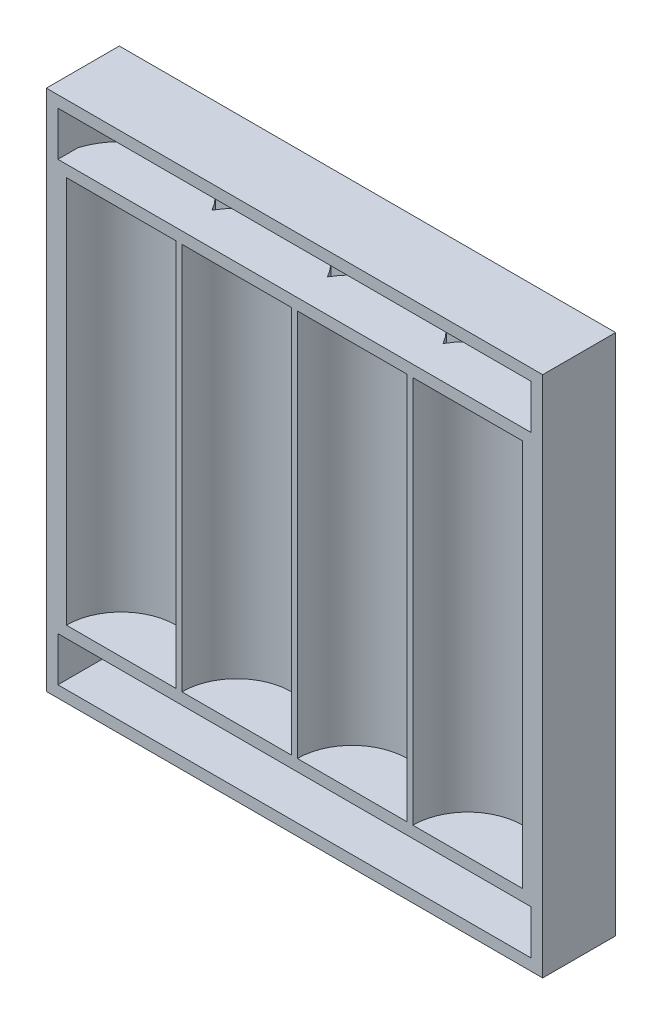
ISO-10303-21;
HEADER;
FILE_DESCRIPTION(('STEP AP214'),'2;1');
FILE_NAME('part.step','',(''),(''),'','','');
FILE_SCHEMA(('AUTOMOTIVE_DESIGN { 1 0 10303 214 1 1 1 1 }'));
ENDSEC;
DATA;
#1=APPLICATION_CONTEXT('core data for automotive mechanical design processes');
#2=APPLICATION_PROTOCOL_DEFINITION('international standard','automotive_design',2000,#1);
#3=PRODUCT_CONTEXT('',#1,'mechanical');
#4=PRODUCT('Part','Part','',(#3));
#5=PRODUCT_RELATED_PRODUCT_CATEGORY('part','',(#4));
#6=PRODUCT_DEFINITION_FORMATION('','',#4);
#7=PRODUCT_DEFINITION_CONTEXT('part definition',#1,'design');
#8=PRODUCT_DEFINITION('design','',#6,#7);
#9=PRODUCT_DEFINITION_SHAPE('','',#8);
#10=(LENGTH_UNIT() NAMED_UNIT(*) SI_UNIT(.MILLI.,.METRE.));
#11=(NAMED_UNIT(*) PLANE_ANGLE_UNIT() SI_UNIT($,.RADIAN.));
#12=(NAMED_UNIT(*) SI_UNIT($,.STERADIAN.) SOLID_ANGLE_UNIT());
#13=UNCERTAINTY_MEASURE_WITH_UNIT(LENGTH_MEASURE(1.E-05),#10,'distance_accuracy_value','');
#14=(GEOMETRIC_REPRESENTATION_CONTEXT(3) GLOBAL_UNCERTAINTY_ASSIGNED_CONTEXT((#13)) GLOBAL_UNIT_ASSIGNED_CONTEXT((#10,
#11,#12)) REPRESENTATION_CONTEXT('',''));
#15=CARTESIAN_POINT('',(0.,0.,0.));
#16=DIRECTION('',(0.,0.,1.));
#17=DIRECTION('',(1.,0.,0.));
#18=AXIS2_PLACEMENT_3D('',#15,#16,#17);
#19=CARTESIAN_POINT('',(0.,67.85,9.475));
#20=DIRECTION('',(0.,0.,-1.));
#21=DIRECTION('',(-1.,0.,0.));
#22=AXIS2_PLACEMENT_3D('',#19,#20,#21);
#23=PLANE('',#22);
#24=DIRECTION('',(1.,0.,0.));
#25=VECTOR('',#24,1.);
#26=CARTESIAN_POINT('',(24.725,7.255,9.475));
#27=LINE('',#26,#25);
#28=CARTESIAN_POINT('',(1.5,7.255,9.475));
#29=VERTEX_POINT('',#28);
#30=CARTESIAN_POINT('',(62.95,7.255,9.475));
#31=VERTEX_POINT('',#30);
#32=EDGE_CURVE('E232',#29,#31,#27,.T.);
#33=ORIENTED_EDGE('',*,*,#32,.T.);
#34=DIRECTION('',(0.,-1.,0.));
#35=VECTOR('',#34,1.);
#36=CARTESIAN_POINT('',(62.95,0.,9.475));
#37=LINE('',#36,#35);
#38=CARTESIAN_POINT('',(62.95,1.5,9.475));
#39=VERTEX_POINT('',#38);
#40=EDGE_CURVE('E229',#31,#39,#37,.T.);
#41=ORIENTED_EDGE('',*,*,#40,.T.);
#42=DIRECTION('',(1.,0.,0.));
#43=VECTOR('',#42,1.);
#44=CARTESIAN_POINT('',(0.,1.5,9.475));
#45=LINE('',#44,#43);
#46=CARTESIAN_POINT('',(1.5,1.5,9.475));
#47=VERTEX_POINT('',#46);
#48=EDGE_CURVE('E226',#47,#39,#45,.T.);
#49=ORIENTED_EDGE('',*,*,#48,.F.);
#50=DIRECTION('',(0.,-1.,0.));
#51=VECTOR('',#50,1.);
#52=CARTESIAN_POINT('',(1.5,67.85,9.475));
#53=LINE('',#52,#51);
#54=EDGE_CURVE('E193',#29,#47,#53,.T.);
#55=ORIENTED_EDGE('',*,*,#54,.F.);
#56=EDGE_LOOP('',(#33,#41,#49,#55));
#57=FACE_BOUND('',#56,.T.);
#58=DIRECTION('',(1.,0.,0.));
#59=VECTOR('',#58,1.);
#60=CARTESIAN_POINT('',(0.,0.,9.475));
#61=LINE('',#60,#59);
#62=CARTESIAN_POINT('',(0.,0.,9.475));
#63=VERTEX_POINT('',#62);
#64=CARTESIAN_POINT('',(64.45,0.,9.475));
#65=VERTEX_POINT('',#64);
#66=EDGE_CURVE('E275',#63,#65,#61,.T.);
#67=ORIENTED_EDGE('',*,*,#66,.T.);
#68=DIRECTION('',(0.,-1.,0.));
#69=VECTOR('',#68,1.);
#70=CARTESIAN_POINT('',(64.45,67.85,9.475));
#71=LINE('',#70,#69);
#72=CARTESIAN_POINT('',(64.45,67.85,9.475));
#73=VERTEX_POINT('',#72);
#74=EDGE_CURVE('E281',#73,#65,#71,.T.);
#75=ORIENTED_EDGE('',*,*,#74,.F.);
#76=DIRECTION('',(1.,0.,0.));
#77=VECTOR('',#76,1.);
#78=CARTESIAN_POINT('',(0.,67.85,9.475));
#79=LINE('',#78,#77);
#80=CARTESIAN_POINT('',(0.,67.85,9.475));
#81=VERTEX_POINT('',#80);
#82=EDGE_CURVE('E276',#81,#73,#79,.T.);
#83=ORIENTED_EDGE('',*,*,#82,.F.);
#84=DIRECTION('',(0.,-1.,0.));
#85=VECTOR('',#84,1.);
#86=CARTESIAN_POINT('',(0.,67.85,9.475));
#87=LINE('',#86,#85);
#88=EDGE_CURVE('E279',#81,#63,#87,.T.);
#89=ORIENTED_EDGE('',*,*,#88,.T.);
#90=EDGE_LOOP('',(#67,#75,#83,#89));
#91=FACE_BOUND('',#90,.T.);
#92=DIRECTION('',(1.,0.,0.));
#93=VECTOR('',#92,1.);
#94=CARTESIAN_POINT('',(54.725,59.095,9.475));
#95=LINE('',#94,#93);
#96=CARTESIAN_POINT('',(47.59,59.095,9.475));
#97=VERTEX_POINT('',#96);
#98=CARTESIAN_POINT('',(61.86,59.095,9.475));
#99=VERTEX_POINT('',#98);
#100=EDGE_CURVE('E291',#97,#99,#95,.T.);
#101=ORIENTED_EDGE('',*,*,#100,.T.);
#102=DIRECTION('',(0.,-1.,0.));
#103=VECTOR('',#102,1.);
#104=CARTESIAN_POINT('',(61.86,59.095,9.475));
#105=LINE('',#104,#103);
#106=CARTESIAN_POINT('',(61.86,8.755,9.475));
#107=VERTEX_POINT('',#106);
#108=EDGE_CURVE('E288',#107,#99,#105,.F.);
#109=ORIENTED_EDGE('',*,*,#108,.F.);
#110=DIRECTION('',(1.,0.,0.));
#111=VECTOR('',#110,1.);
#112=CARTESIAN_POINT('',(54.725,8.755,9.475));
#113=LINE('',#112,#111);
#114=CARTESIAN_POINT('',(47.59,8.755,9.475));
#115=VERTEX_POINT('',#114);
#116=EDGE_CURVE('E11',#115,#107,#113,.T.);
#117=ORIENTED_EDGE('',*,*,#116,.F.);
#118=DIRECTION('',(0.,-1.,0.));
#119=VECTOR('',#118,1.);
#120=CARTESIAN_POINT('',(47.59,59.095,9.475));
#121=LINE('',#120,#119);
#122=EDGE_CURVE('E284',#97,#115,#121,.T.);
#123=ORIENTED_EDGE('',*,*,#122,.F.);
#124=EDGE_LOOP('',(#101,#109,#117,#123));
#125=FACE_BOUND('',#124,.T.);
#126=DIRECTION('',(1.,0.,0.));
#127=VECTOR('',#126,1.);
#128=CARTESIAN_POINT('',(39.725,59.095,9.475));
#129=LINE('',#128,#127);
#130=CARTESIAN_POINT('',(32.59,59.095,9.475));
#131=VERTEX_POINT('',#130);
#132=CARTESIAN_POINT('',(46.86,59.095,9.475));
#133=VERTEX_POINT('',#132);
#134=EDGE_CURVE('E302',#131,#133,#129,.T.);
#135=ORIENTED_EDGE('',*,*,#134,.T.);
#136=DIRECTION('',(0.,-1.,0.));
#137=VECTOR('',#136,1.);
#138=CARTESIAN_POINT('',(46.86,59.095,9.475));
#139=LINE('',#138,#137);
#140=CARTESIAN_POINT('',(46.86,8.755,9.475));
#141=VERTEX_POINT('',#140);
#142=EDGE_CURVE('E299',#141,#133,#139,.F.);
#143=ORIENTED_EDGE('',*,*,#142,.F.);
#144=DIRECTION('',(1.,0.,0.));
#145=VECTOR('',#144,1.);
#146=CARTESIAN_POINT('',(39.725,8.755,9.475));
#147=LINE('',#146,#145);
#148=CARTESIAN_POINT('',(32.59,8.755,9.475));
#149=VERTEX_POINT('',#148);
#150=EDGE_CURVE('E293',#149,#141,#147,.T.);
#151=ORIENTED_EDGE('',*,*,#150,.F.);
#152=DIRECTION('',(0.,-1.,0.));
#153=VECTOR('',#152,1.);
#154=CARTESIAN_POINT('',(32.59,59.095,9.475));
#155=LINE('',#154,#153);
#156=EDGE_CURVE('E296',#131,#149,#155,.T.);
#157=ORIENTED_EDGE('',*,*,#156,.F.);
#158=EDGE_LOOP('',(#135,#143,#151,#157));
#159=FACE_BOUND('',#158,.T.);
#160=DIRECTION('',(1.,0.,0.));
#161=VECTOR('',#160,1.);
#162=CARTESIAN_POINT('',(24.725,59.095,9.475));
#163=LINE('',#162,#161);
#164=CARTESIAN_POINT('',(17.59,59.095,9.475));
#165=VERTEX_POINT('',#164);
#166=CARTESIAN_POINT('',(31.86,59.095,9.475));
#167=VERTEX_POINT('',#166);
#168=EDGE_CURVE('E313',#165,#167,#163,.T.);
#169=ORIENTED_EDGE('',*,*,#168,.T.);
#170=DIRECTION('',(0.,-1.,0.));
#171=VECTOR('',#170,1.);
#172=CARTESIAN_POINT('',(31.86,59.095,9.475));
#173=LINE('',#172,#171);
#174=CARTESIAN_POINT('',(31.86,8.755,9.475));
#175=VERTEX_POINT('',#174);
#176=EDGE_CURVE('E310',#175,#167,#173,.F.);
#177=ORIENTED_EDGE('',*,*,#176,.F.);
#178=DIRECTION('',(1.,0.,0.));
#179=VECTOR('',#178,1.);
#180=CARTESIAN_POINT('',(24.725,8.755,9.475));
#181=LINE('',#180,#179);
#182=CARTESIAN_POINT('',(17.59,8.755,9.475));
#183=VERTEX_POINT('',#182);
#184=EDGE_CURVE('E304',#183,#175,#181,.T.);
#185=ORIENTED_EDGE('',*,*,#184,.F.);
#186=DIRECTION('',(0.,-1.,0.));
#187=VECTOR('',#186,1.);
#188=CARTESIAN_POINT('',(17.59,59.095,9.475));
#189=LINE('',#188,#187);
#190=EDGE_CURVE('E307',#165,#183,#189,.T.);
#191=ORIENTED_EDGE('',*,*,#190,.F.);
#192=EDGE_LOOP('',(#169,#177,#185,#191));
#193=FACE_BOUND('',#192,.T.);
#194=DIRECTION('',(1.,0.,0.));
#195=VECTOR('',#194,1.);
#196=CARTESIAN_POINT('',(9.725,59.095,9.475));
#197=LINE('',#196,#195);
#198=CARTESIAN_POINT('',(2.59,59.095,9.475));
#199=VERTEX_POINT('',#198);
#200=CARTESIAN_POINT('',(16.86,59.095,9.475));
#201=VERTEX_POINT('',#200);
#202=EDGE_CURVE('E324',#199,#201,#197,.T.);
#203=ORIENTED_EDGE('',*,*,#202,.T.);
#204=DIRECTION('',(0.,-1.,0.));
#205=VECTOR('',#204,1.);
#206=CARTESIAN_POINT('',(16.86,59.095,9.475));
#207=LINE('',#206,#205);
#208=CARTESIAN_POINT('',(16.86,8.755,9.475));
#209=VERTEX_POINT('',#208);
#210=EDGE_CURVE('E321',#209,#201,#207,.F.);
#211=ORIENTED_EDGE('',*,*,#210,.F.);
#212=DIRECTION('',(1.,0.,0.));
#213=VECTOR('',#212,1.);
#214=CARTESIAN_POINT('',(9.725,8.755,9.475));
#215=LINE('',#214,#213);
#216=CARTESIAN_POINT('',(2.59,8.755,9.475));
#217=VERTEX_POINT('',#216);
#218=EDGE_CURVE('E315',#217,#209,#215,.T.);
#219=ORIENTED_EDGE('',*,*,#218,.F.);
#220=DIRECTION('',(0.,-1.,0.));
#221=VECTOR('',#220,1.);
#222=CARTESIAN_POINT('',(2.59,59.095,9.475));
#223=LINE('',#222,#221);
#224=EDGE_CURVE('E318',#199,#217,#223,.T.);
#225=ORIENTED_EDGE('',*,*,#224,.F.);
#226=EDGE_LOOP('',(#203,#211,#219,#225));
#227=FACE_BOUND('',#226,.T.);
#228=DIRECTION('',(1.,0.,0.));
#229=VECTOR('',#228,1.);
#230=CARTESIAN_POINT('',(24.725,60.595,9.475));
#231=LINE('',#230,#229);
#232=CARTESIAN_POINT('',(1.5,60.595,9.475));
#233=VERTEX_POINT('',#232);
#234=CARTESIAN_POINT('',(62.95,60.595,9.475));
#235=VERTEX_POINT('',#234);
#236=EDGE_CURVE('E246',#233,#235,#231,.T.);
#237=ORIENTED_EDGE('',*,*,#236,.F.);
#238=CARTESIAN_POINT('',(1.5,66.35,9.475));
#239=VERTEX_POINT('',#238);
#240=EDGE_CURVE('E223',#239,#233,#53,.T.);
#241=ORIENTED_EDGE('',*,*,#240,.F.);
#242=DIRECTION('',(1.,0.,0.));
#243=VECTOR('',#242,1.);
#244=CARTESIAN_POINT('',(0.,66.35,9.475));
#245=LINE('',#244,#243);
#246=CARTESIAN_POINT('',(62.95,66.35,9.475));
#247=VERTEX_POINT('',#246);
#248=EDGE_CURVE('E228',#239,#247,#245,.T.);
#249=ORIENTED_EDGE('',*,*,#248,.T.);
#250=EDGE_CURVE('E225',#247,#235,#37,.T.);
#251=ORIENTED_EDGE('',*,*,#250,.T.);
#252=EDGE_LOOP('',(#237,#241,#249,#251));
#253=FACE_BOUND('',#252,.T.);
#254=ADVANCED_FACE('F36',(#57,#91,#125,#159,#193,#227,#253),#23,.F.);
#255=CARTESIAN_POINT('',(54.725,59.095,9.475));
#256=DIRECTION('',(0.,-1.,0.));
#257=DIRECTION('',(0.,0.,-1.));
#258=AXIS2_PLACEMENT_3D('',#255,#256,#257);
#259=CYLINDRICAL_SURFACE('',#258,7.135);
#260=CARTESIAN_POINT('',(54.725,8.755,9.475));
#261=DIRECTION('',(0.,-1.,0.));
#262=DIRECTION('',(0.,0.,-1.));
#263=AXIS2_PLACEMENT_3D('',#260,#261,#262);
#264=CIRCLE('',#263,7.135);
#265=EDGE_CURVE('E346',#115,#107,#264,.T.);
#266=ORIENTED_EDGE('',*,*,#265,.T.);
#267=ORIENTED_EDGE('',*,*,#108,.T.);
#268=CARTESIAN_POINT('',(54.725,59.095,9.475));
#269=DIRECTION('',(0.,-1.,0.));
#270=DIRECTION('',(0.,0.,-1.));
#271=AXIS2_PLACEMENT_3D('',#268,#269,#270);
#272=CIRCLE('',#271,7.135);
#273=EDGE_CURVE('E326',#97,#99,#272,.T.);
#274=ORIENTED_EDGE('',*,*,#273,.F.);
#275=ORIENTED_EDGE('',*,*,#122,.T.);
#276=EDGE_LOOP('',(#266,#267,#274,#275));
#277=FACE_BOUND('',#276,.T.);
#278=ADVANCED_FACE('F389',(#277),#259,.F.);
#279=CARTESIAN_POINT('',(54.725,59.095,9.475));
#280=DIRECTION('',(0.,-1.,0.));
#281=DIRECTION('',(0.,0.,-1.));
#282=AXIS2_PLACEMENT_3D('',#279,#280,#281);
#283=PLANE('',#282);
#284=ORIENTED_EDGE('',*,*,#100,.F.);
#285=ORIENTED_EDGE('',*,*,#273,.T.);
#286=EDGE_LOOP('',(#284,#285));
#287=FACE_BOUND('',#286,.T.);
#288=ADVANCED_FACE('F474',(#287),#283,.T.);
#289=CARTESIAN_POINT('',(54.725,8.755,9.475));
#290=DIRECTION('',(0.,-1.,0.));
#291=DIRECTION('',(0.,0.,-1.));
#292=AXIS2_PLACEMENT_3D('',#289,#290,#291);
#293=PLANE('',#292);
#294=ORIENTED_EDGE('',*,*,#265,.F.);
#295=ORIENTED_EDGE('',*,*,#116,.T.);
#296=EDGE_LOOP('',(#294,#295));
#297=FACE_BOUND('',#296,.T.);
#298=ADVANCED_FACE('F464',(#297),#293,.F.);
#299=CARTESIAN_POINT('',(39.725,59.095,9.475));
#300=DIRECTION('',(0.,-1.,0.));
#301=DIRECTION('',(0.,0.,-1.));
#302=AXIS2_PLACEMENT_3D('',#299,#300,#301);
#303=CYLINDRICAL_SURFACE('',#302,7.135);
#304=CARTESIAN_POINT('',(39.725,8.755,9.475));
#305=DIRECTION('',(0.,-1.,0.));
#306=DIRECTION('',(0.,0.,-1.));
#307=AXIS2_PLACEMENT_3D('',#304,#305,#306);
#308=CIRCLE('',#307,7.135);
#309=EDGE_CURVE('E340',#149,#141,#308,.T.);
#310=ORIENTED_EDGE('',*,*,#309,.T.);
#311=ORIENTED_EDGE('',*,*,#142,.T.);
#312=CARTESIAN_POINT('',(39.725,59.095,9.475));
#313=DIRECTION('',(0.,-1.,0.));
#314=DIRECTION('',(0.,0.,-1.));
#315=AXIS2_PLACEMENT_3D('',#312,#313,#314);
#316=CIRCLE('',#315,7.135);
#317=EDGE_CURVE('E343',#131,#133,#316,.T.);
#318=ORIENTED_EDGE('',*,*,#317,.F.);
#319=ORIENTED_EDGE('',*,*,#156,.T.);
#320=EDGE_LOOP('',(#310,#311,#318,#319));
#321=FACE_BOUND('',#320,.T.);
#322=ADVANCED_FACE('F460',(#321),#303,.F.);
#323=CARTESIAN_POINT('',(39.725,59.095,9.475));
#324=DIRECTION('',(0.,-1.,0.));
#325=DIRECTION('',(0.,0.,-1.));
#326=AXIS2_PLACEMENT_3D('',#323,#324,#325);
#327=PLANE('',#326);
#328=ORIENTED_EDGE('',*,*,#134,.F.);
#329=ORIENTED_EDGE('',*,*,#317,.T.);
#330=EDGE_LOOP('',(#328,#329));
#331=FACE_BOUND('',#330,.T.);
#332=ADVANCED_FACE('F463',(#331),#327,.T.);
#333=CARTESIAN_POINT('',(39.725,8.755,9.475));
#334=DIRECTION('',(0.,-1.,0.));
#335=DIRECTION('',(0.,0.,-1.));
#336=AXIS2_PLACEMENT_3D('',#333,#334,#335);
#337=PLANE('',#336);
#338=ORIENTED_EDGE('',*,*,#309,.F.);
#339=ORIENTED_EDGE('',*,*,#150,.T.);
#340=EDGE_LOOP('',(#338,#339));
#341=FACE_BOUND('',#340,.T.);
#342=ADVANCED_FACE('F452',(#341),#337,.F.);
#343=CARTESIAN_POINT('',(24.725,59.095,9.475));
#344=DIRECTION('',(0.,-1.,0.));
#345=DIRECTION('',(0.,0.,-1.));
#346=AXIS2_PLACEMENT_3D('',#343,#344,#345);
#347=CYLINDRICAL_SURFACE('',#346,7.135);
#348=CARTESIAN_POINT('',(24.725,8.755,9.475));
#349=DIRECTION('',(0.,-1.,0.));
#350=DIRECTION('',(0.,0.,-1.));
#351=AXIS2_PLACEMENT_3D('',#348,#349,#350);
#352=CIRCLE('',#351,7.135);
#353=EDGE_CURVE('E334',#183,#175,#352,.T.);
#354=ORIENTED_EDGE('',*,*,#353,.T.);
#355=ORIENTED_EDGE('',*,*,#176,.T.);
#356=CARTESIAN_POINT('',(24.725,59.095,9.475));
#357=DIRECTION('',(0.,-1.,0.));
#358=DIRECTION('',(0.,0.,-1.));
#359=AXIS2_PLACEMENT_3D('',#356,#357,#358);
#360=CIRCLE('',#359,7.135);
#361=EDGE_CURVE('E337',#165,#167,#360,.T.);
#362=ORIENTED_EDGE('',*,*,#361,.F.);
#363=ORIENTED_EDGE('',*,*,#190,.T.);
#364=EDGE_LOOP('',(#354,#355,#362,#363));
#365=FACE_BOUND('',#364,.T.);
#366=ADVANCED_FACE('F448',(#365),#347,.F.);
#367=CARTESIAN_POINT('',(24.725,59.095,9.475));
#368=DIRECTION('',(0.,-1.,0.));
#369=DIRECTION('',(0.,0.,-1.));
#370=AXIS2_PLACEMENT_3D('',#367,#368,#369);
#371=PLANE('',#370);
#372=ORIENTED_EDGE('',*,*,#168,.F.);
#373=ORIENTED_EDGE('',*,*,#361,.T.);
#374=EDGE_LOOP('',(#372,#373));
#375=FACE_BOUND('',#374,.T.);
#376=ADVANCED_FACE('F451',(#375),#371,.T.);
#377=CARTESIAN_POINT('',(24.725,8.755,9.475));
#378=DIRECTION('',(0.,-1.,0.));
#379=DIRECTION('',(0.,0.,-1.));
#380=AXIS2_PLACEMENT_3D('',#377,#378,#379);
#381=PLANE('',#380);
#382=ORIENTED_EDGE('',*,*,#353,.F.);
#383=ORIENTED_EDGE('',*,*,#184,.T.);
#384=EDGE_LOOP('',(#382,#383));
#385=FACE_BOUND('',#384,.T.);
#386=ADVANCED_FACE('F446',(#385),#381,.F.);
#387=CARTESIAN_POINT('',(9.725,59.095,9.47499999999999));
#388=DIRECTION('',(0.,-1.,0.));
#389=DIRECTION('',(0.,0.,-1.));
#390=AXIS2_PLACEMENT_3D('',#387,#388,#389);
#391=CYLINDRICAL_SURFACE('',#390,7.135);
#392=CARTESIAN_POINT('',(9.725,8.755,9.47499999999999));
#393=DIRECTION('',(0.,-1.,0.));
#394=DIRECTION('',(0.,0.,-1.));
#395=AXIS2_PLACEMENT_3D('',#392,#393,#394);
#396=CIRCLE('',#395,7.135);
#397=EDGE_CURVE('E331',#217,#209,#396,.T.);
#398=ORIENTED_EDGE('',*,*,#397,.T.);
#399=ORIENTED_EDGE('',*,*,#210,.T.);
#400=CARTESIAN_POINT('',(9.725,59.095,9.47499999999999));
#401=DIRECTION('',(0.,-1.,0.));
#402=DIRECTION('',(0.,0.,-1.));
#403=AXIS2_PLACEMENT_3D('',#400,#401,#402);
#404=CIRCLE('',#403,7.135);
#405=EDGE_CURVE('E327',#199,#201,#404,.T.);
#406=ORIENTED_EDGE('',*,*,#405,.F.);
#407=ORIENTED_EDGE('',*,*,#224,.T.);
#408=EDGE_LOOP('',(#398,#399,#406,#407));
#409=FACE_BOUND('',#408,.T.);
#410=ADVANCED_FACE('F439',(#409),#391,.F.);
#411=CARTESIAN_POINT('',(9.725,59.095,9.47499999999999));
#412=DIRECTION('',(0.,-1.,0.));
#413=DIRECTION('',(0.,0.,-1.));
#414=AXIS2_PLACEMENT_3D('',#411,#412,#413);
#415=PLANE('',#414);
#416=ORIENTED_EDGE('',*,*,#202,.F.);
#417=ORIENTED_EDGE('',*,*,#405,.T.);
#418=EDGE_LOOP('',(#416,#417));
#419=FACE_BOUND('',#418,.T.);
#420=ADVANCED_FACE('F435',(#419),#415,.T.);
#421=CARTESIAN_POINT('',(9.725,8.755,9.47499999999999));
#422=DIRECTION('',(0.,-1.,0.));
#423=DIRECTION('',(0.,0.,-1.));
#424=AXIS2_PLACEMENT_3D('',#421,#422,#423);
#425=PLANE('',#424);
#426=ORIENTED_EDGE('',*,*,#397,.F.);
#427=ORIENTED_EDGE('',*,*,#218,.T.);
#428=EDGE_LOOP('',(#426,#427));
#429=FACE_BOUND('',#428,.T.);
#430=ADVANCED_FACE('F438',(#429),#425,.F.);
#431=CARTESIAN_POINT('',(0.,0.,18.95));
#432=DIRECTION('',(1.,0.,0.));
#433=DIRECTION('',(0.,0.,-1.));
#434=AXIS2_PLACEMENT_3D('',#431,#432,#433);
#435=PLANE('',#434);
#436=DIRECTION('',(0.,0.,-1.));
#437=VECTOR('',#436,1.);
#438=CARTESIAN_POINT('',(0.,0.,18.95));
#439=LINE('',#438,#437);
#440=CARTESIAN_POINT('',(0.,0.,0.));
#441=VERTEX_POINT('',#440);
#442=EDGE_CURVE('E44',#63,#441,#439,.T.);
#443=ORIENTED_EDGE('',*,*,#442,.F.);
#444=ORIENTED_EDGE('',*,*,#88,.F.);
#445=DIRECTION('',(0.,0.,-1.));
#446=VECTOR('',#445,1.);
#447=CARTESIAN_POINT('',(0.,67.85,18.95));
#448=LINE('',#447,#446);
#449=CARTESIAN_POINT('',(0.,67.85,0.));
#450=VERTEX_POINT('',#449);
#451=EDGE_CURVE('E362',#81,#450,#448,.T.);
#452=ORIENTED_EDGE('',*,*,#451,.T.);
#453=DIRECTION('',(0.,-1.,0.));
#454=VECTOR('',#453,1.);
#455=CARTESIAN_POINT('',(0.,0.,0.));
#456=LINE('',#455,#454);
#457=EDGE_CURVE('E330',#450,#441,#456,.T.);
#458=ORIENTED_EDGE('',*,*,#457,.T.);
#459=EDGE_LOOP('',(#443,#444,#452,#458));
#460=FACE_BOUND('',#459,.T.);
#461=ADVANCED_FACE('F38',(#460),#435,.F.);
#462=CARTESIAN_POINT('',(0.,0.,18.95));
#463=DIRECTION('',(0.,1.,0.));
#464=DIRECTION('',(0.,0.,1.));
#465=AXIS2_PLACEMENT_3D('',#462,#463,#464);
#466=PLANE('',#465);
#467=DIRECTION('',(0.,0.,-1.));
#468=VECTOR('',#467,1.);
#469=CARTESIAN_POINT('',(64.45,0.,18.95));
#470=LINE('',#469,#468);
#471=CARTESIAN_POINT('',(64.45,0.,0.));
#472=VERTEX_POINT('',#471);
#473=EDGE_CURVE('E366',#65,#472,#470,.T.);
#474=ORIENTED_EDGE('',*,*,#473,.F.);
#475=ORIENTED_EDGE('',*,*,#66,.F.);
#476=ORIENTED_EDGE('',*,*,#442,.T.);
#477=DIRECTION('',(1.,0.,0.));
#478=VECTOR('',#477,1.);
#479=CARTESIAN_POINT('',(0.,0.,0.));
#480=LINE('',#479,#478);
#481=EDGE_CURVE('E353',#441,#472,#480,.T.);
#482=ORIENTED_EDGE('',*,*,#481,.T.);
#483=EDGE_LOOP('',(#474,#475,#476,#482));
#484=FACE_BOUND('',#483,.T.);
#485=ADVANCED_FACE('F372',(#484),#466,.F.);
#486=CARTESIAN_POINT('',(64.45,0.,18.95));
#487=DIRECTION('',(-1.,0.,0.));
#488=DIRECTION('',(0.,0.,1.));
#489=AXIS2_PLACEMENT_3D('',#486,#487,#488);
#490=PLANE('',#489);
#491=DIRECTION('',(0.,0.,-1.));
#492=VECTOR('',#491,1.);
#493=CARTESIAN_POINT('',(64.45,67.85,18.95));
#494=LINE('',#493,#492);
#495=CARTESIAN_POINT('',(64.45,67.85,0.));
#496=VERTEX_POINT('',#495);
#497=EDGE_CURVE('E364',#73,#496,#494,.T.);
#498=ORIENTED_EDGE('',*,*,#497,.F.);
#499=ORIENTED_EDGE('',*,*,#74,.T.);
#500=ORIENTED_EDGE('',*,*,#473,.T.);
#501=DIRECTION('',(0.,1.,0.));
#502=VECTOR('',#501,1.);
#503=CARTESIAN_POINT('',(64.45,0.,0.));
#504=LINE('',#503,#502);
#505=EDGE_CURVE('E356',#472,#496,#504,.T.);
#506=ORIENTED_EDGE('',*,*,#505,.T.);
#507=EDGE_LOOP('',(#498,#499,#500,#506));
#508=FACE_BOUND('',#507,.T.);
#509=ADVANCED_FACE('F385',(#508),#490,.F.);
#510=CARTESIAN_POINT('',(0.,67.85,18.95));
#511=DIRECTION('',(0.,-1.,0.));
#512=DIRECTION('',(0.,0.,-1.));
#513=AXIS2_PLACEMENT_3D('',#510,#511,#512);
#514=PLANE('',#513);
#515=ORIENTED_EDGE('',*,*,#451,.F.);
#516=ORIENTED_EDGE('',*,*,#82,.T.);
#517=ORIENTED_EDGE('',*,*,#497,.T.);
#518=DIRECTION('',(-1.,0.,0.));
#519=VECTOR('',#518,1.);
#520=CARTESIAN_POINT('',(0.,67.85,0.));
#521=LINE('',#520,#519);
#522=EDGE_CURVE('E359',#496,#450,#521,.T.);
#523=ORIENTED_EDGE('',*,*,#522,.T.);
#524=EDGE_LOOP('',(#515,#516,#517,#523));
#525=FACE_BOUND('',#524,.T.);
#526=ADVANCED_FACE('F382',(#525),#514,.F.);
#527=CARTESIAN_POINT('',(0.,0.,0.));
#528=DIRECTION('',(0.,0.,-1.));
#529=DIRECTION('',(-1.,0.,0.));
#530=AXIS2_PLACEMENT_3D('',#527,#528,#529);
#531=PLANE('',#530);
#532=ORIENTED_EDGE('',*,*,#457,.F.);
#533=ORIENTED_EDGE('',*,*,#522,.F.);
#534=ORIENTED_EDGE('',*,*,#505,.F.);
#535=ORIENTED_EDGE('',*,*,#481,.F.);
#536=EDGE_LOOP('',(#532,#533,#534,#535));
#537=FACE_BOUND('',#536,.T.);
#538=ADVANCED_FACE('F378',(#537),#531,.T.);
#539=CARTESIAN_POINT('',(39.725,59.095,9.475));
#540=DIRECTION('',(0.,-1.,0.));
#541=DIRECTION('',(0.,0.,-1.));
#542=AXIS2_PLACEMENT_3D('',#539,#540,#541);
#543=CYLINDRICAL_SURFACE('',#542,8.635);
#544=DIRECTION('',(0.,-1.,0.));
#545=VECTOR('',#544,1.);
#546=CARTESIAN_POINT('',(47.225,33.925,5.19560459877798));
#547=LINE('',#546,#545);
#548=CARTESIAN_POINT('',(47.225,60.595,5.19560459877799));
#549=VERTEX_POINT('',#548);
#550=CARTESIAN_POINT('',(47.225,7.255,5.19560459877799));
#551=VERTEX_POINT('',#550);
#552=EDGE_CURVE('E273',#549,#551,#547,.T.);
#553=ORIENTED_EDGE('',*,*,#552,.T.);
#554=CARTESIAN_POINT('',(39.725,7.255,9.475));
#555=DIRECTION('',(0.,-1.,0.));
#556=DIRECTION('',(0.,0.,-1.));
#557=AXIS2_PLACEMENT_3D('',#554,#555,#556);
#558=CIRCLE('',#557,8.635);
#559=CARTESIAN_POINT('',(32.225,7.255,5.19560459877799));
#560=VERTEX_POINT('',#559);
#561=EDGE_CURVE('E243',#560,#551,#558,.T.);
#562=ORIENTED_EDGE('',*,*,#561,.F.);
#563=DIRECTION('',(0.,-1.,0.));
#564=VECTOR('',#563,1.);
#565=CARTESIAN_POINT('',(32.225,33.925,5.19560459877799));
#566=LINE('',#565,#564);
#567=CARTESIAN_POINT('',(32.225,60.595,5.19560459877799));
#568=VERTEX_POINT('',#567);
#569=EDGE_CURVE('E269',#560,#568,#566,.F.);
#570=ORIENTED_EDGE('',*,*,#569,.T.);
#571=CARTESIAN_POINT('',(39.725,60.595,9.475));
#572=DIRECTION('',(0.,-1.,0.));
#573=DIRECTION('',(0.,0.,-1.));
#574=AXIS2_PLACEMENT_3D('',#571,#572,#573);
#575=CIRCLE('',#574,8.635);
#576=EDGE_CURVE('E252',#568,#549,#575,.T.);
#577=ORIENTED_EDGE('',*,*,#576,.T.);
#578=EDGE_LOOP('',(#553,#562,#570,#577));
#579=FACE_BOUND('',#578,.T.);
#580=ADVANCED_FACE('F484',(#579),#543,.T.);
#581=CARTESIAN_POINT('',(9.725,59.095,9.47499999999999));
#582=DIRECTION('',(0.,-1.,0.));
#583=DIRECTION('',(0.,0.,-1.));
#584=AXIS2_PLACEMENT_3D('',#581,#582,#583);
#585=CYLINDRICAL_SURFACE('',#584,8.635);
#586=DIRECTION('',(0.,-1.,0.));
#587=VECTOR('',#586,1.);
#588=CARTESIAN_POINT('',(17.225,33.925,5.19560459877799));
#589=LINE('',#588,#587);
#590=CARTESIAN_POINT('',(17.225,60.595,5.19560459877799));
#591=VERTEX_POINT('',#590);
#592=CARTESIAN_POINT('',(17.225,7.255,5.19560459877799));
#593=VERTEX_POINT('',#592);
#594=EDGE_CURVE('E271',#591,#593,#589,.T.);
#595=ORIENTED_EDGE('',*,*,#594,.T.);
#596=CARTESIAN_POINT('',(9.725,7.255,9.47499999999999));
#597=DIRECTION('',(0.,-1.,0.));
#598=DIRECTION('',(0.,0.,-1.));
#599=AXIS2_PLACEMENT_3D('',#596,#597,#598);
#600=CIRCLE('',#599,8.635);
#601=CARTESIAN_POINT('',(1.5,7.255,6.84581761758527));
#602=VERTEX_POINT('',#601);
#603=EDGE_CURVE('E214',#602,#593,#600,.T.);
#604=ORIENTED_EDGE('',*,*,#603,.F.);
#605=DIRECTION('',(0.,-1.,0.));
#606=VECTOR('',#605,1.);
#607=CARTESIAN_POINT('',(1.5,59.095,6.84581761758527));
#608=LINE('',#607,#606);
#609=CARTESIAN_POINT('',(1.5,60.595,6.84581761758527));
#610=VERTEX_POINT('',#609);
#611=EDGE_CURVE('E266',#602,#610,#608,.F.);
#612=ORIENTED_EDGE('',*,*,#611,.T.);
#613=CARTESIAN_POINT('',(9.725,60.595,9.47499999999999));
#614=DIRECTION('',(0.,-1.,0.));
#615=DIRECTION('',(0.,0.,-1.));
#616=AXIS2_PLACEMENT_3D('',#613,#614,#615);
#617=CIRCLE('',#616,8.635);
#618=EDGE_CURVE('E211',#610,#591,#617,.T.);
#619=ORIENTED_EDGE('',*,*,#618,.T.);
#620=EDGE_LOOP('',(#595,#604,#612,#619));
#621=FACE_BOUND('',#620,.T.);
#622=ADVANCED_FACE('F412',(#621),#585,.T.);
#623=CARTESIAN_POINT('',(54.725,59.095,9.475));
#624=DIRECTION('',(0.,-1.,0.));
#625=DIRECTION('',(0.,0.,-1.));
#626=AXIS2_PLACEMENT_3D('',#623,#624,#625);
#627=CYLINDRICAL_SURFACE('',#626,8.635);
#628=CARTESIAN_POINT('',(54.725,60.595,9.475));
#629=DIRECTION('',(0.,-1.,0.));
#630=DIRECTION('',(0.,0.,-1.));
#631=AXIS2_PLACEMENT_3D('',#628,#629,#630);
#632=CIRCLE('',#631,8.635);
#633=CARTESIAN_POINT('',(62.95,60.595,6.84581761758524));
#634=VERTEX_POINT('',#633);
#635=EDGE_CURVE('E249',#549,#634,#632,.T.);
#636=ORIENTED_EDGE('',*,*,#635,.T.);
#637=DIRECTION('',(0.,-1.,0.));
#638=VECTOR('',#637,1.);
#639=CARTESIAN_POINT('',(62.95,59.095,6.84581761758524));
#640=LINE('',#639,#638);
#641=CARTESIAN_POINT('',(62.95,7.255,6.84581761758524));
#642=VERTEX_POINT('',#641);
#643=EDGE_CURVE('E263',#634,#642,#640,.T.);
#644=ORIENTED_EDGE('',*,*,#643,.T.);
#645=CARTESIAN_POINT('',(54.725,7.255,9.475));
#646=DIRECTION('',(0.,-1.,0.));
#647=DIRECTION('',(0.,0.,-1.));
#648=AXIS2_PLACEMENT_3D('',#645,#646,#647);
#649=CIRCLE('',#648,8.635);
#650=EDGE_CURVE('E255',#551,#642,#649,.T.);
#651=ORIENTED_EDGE('',*,*,#650,.F.);
#652=ORIENTED_EDGE('',*,*,#552,.F.);
#653=EDGE_LOOP('',(#636,#644,#651,#652));
#654=FACE_BOUND('',#653,.T.);
#655=ADVANCED_FACE('F571',(#654),#627,.T.);
#656=CARTESIAN_POINT('',(62.95,0.,18.95));
#657=DIRECTION('',(-1.,0.,0.));
#658=DIRECTION('',(0.,0.,1.));
#659=AXIS2_PLACEMENT_3D('',#656,#657,#658);
#660=PLANE('',#659);
#661=DIRECTION('',(0.,0.,1.));
#662=VECTOR('',#661,1.);
#663=CARTESIAN_POINT('',(62.95,60.595,18.95));
#664=LINE('',#663,#662);
#665=EDGE_CURVE('E195',#634,#235,#664,.T.);
#666=ORIENTED_EDGE('',*,*,#665,.T.);
#667=ORIENTED_EDGE('',*,*,#250,.F.);
#668=DIRECTION('',(0.,0.,-1.));
#669=VECTOR('',#668,1.);
#670=CARTESIAN_POINT('',(62.95,66.35,18.95));
#671=LINE('',#670,#669);
#672=CARTESIAN_POINT('',(62.95,66.35,1.5));
#673=VERTEX_POINT('',#672);
#674=EDGE_CURVE('E218',#247,#673,#671,.T.);
#675=ORIENTED_EDGE('',*,*,#674,.T.);
#676=DIRECTION('',(0.,1.,0.));
#677=VECTOR('',#676,1.);
#678=CARTESIAN_POINT('',(62.95,0.,1.5));
#679=LINE('',#678,#677);
#680=CARTESIAN_POINT('',(62.95,1.5,1.5));
#681=VERTEX_POINT('',#680);
#682=EDGE_CURVE('E205',#681,#673,#679,.T.);
#683=ORIENTED_EDGE('',*,*,#682,.F.);
#684=DIRECTION('',(0.,0.,-1.));
#685=VECTOR('',#684,1.);
#686=CARTESIAN_POINT('',(62.95,1.5,18.95));
#687=LINE('',#686,#685);
#688=EDGE_CURVE('E196',#39,#681,#687,.T.);
#689=ORIENTED_EDGE('',*,*,#688,.F.);
#690=ORIENTED_EDGE('',*,*,#40,.F.);
#691=DIRECTION('',(0.,0.,-1.));
#692=VECTOR('',#691,1.);
#693=CARTESIAN_POINT('',(62.95,7.255,9.475));
#694=LINE('',#693,#692);
#695=EDGE_CURVE('E257',#31,#642,#694,.T.);
#696=ORIENTED_EDGE('',*,*,#695,.T.);
#697=ORIENTED_EDGE('',*,*,#643,.F.);
#698=EDGE_LOOP('',(#666,#667,#675,#683,#689,#690,#696,#697));
#699=FACE_BOUND('',#698,.T.);
#700=ADVANCED_FACE('F421',(#699),#660,.T.);
#701=CARTESIAN_POINT('',(24.725,59.095,9.475));
#702=DIRECTION('',(0.,-1.,0.));
#703=DIRECTION('',(0.,0.,-1.));
#704=AXIS2_PLACEMENT_3D('',#701,#702,#703);
#705=CYLINDRICAL_SURFACE('',#704,8.635);
#706=CARTESIAN_POINT('',(24.725,60.595,9.475));
#707=DIRECTION('',(0.,-1.,0.));
#708=DIRECTION('',(0.,0.,-1.));
#709=AXIS2_PLACEMENT_3D('',#706,#707,#708);
#710=CIRCLE('',#709,8.635);
#711=EDGE_CURVE('E240',#591,#568,#710,.T.);
#712=ORIENTED_EDGE('',*,*,#711,.T.);
#713=ORIENTED_EDGE('',*,*,#569,.F.);
#714=CARTESIAN_POINT('',(24.725,7.255,9.475));
#715=DIRECTION('',(0.,-1.,0.));
#716=DIRECTION('',(0.,0.,-1.));
#717=AXIS2_PLACEMENT_3D('',#714,#715,#716);
#718=CIRCLE('',#717,8.635);
#719=EDGE_CURVE('E236',#593,#560,#718,.T.);
#720=ORIENTED_EDGE('',*,*,#719,.F.);
#721=ORIENTED_EDGE('',*,*,#594,.F.);
#722=EDGE_LOOP('',(#712,#713,#720,#721));
#723=FACE_BOUND('',#722,.T.);
#724=ADVANCED_FACE('F589',(#723),#705,.T.);
#725=CARTESIAN_POINT('',(9.725,60.595,9.47499999999999));
#726=DIRECTION('',(0.,-1.,0.));
#727=DIRECTION('',(0.,0.,-1.));
#728=AXIS2_PLACEMENT_3D('',#725,#726,#727);
#729=PLANE('',#728);
#730=ORIENTED_EDGE('',*,*,#618,.F.);
#731=DIRECTION('',(0.,0.,1.));
#732=VECTOR('',#731,1.);
#733=CARTESIAN_POINT('',(1.5,60.595,9.47499999999999));
#734=LINE('',#733,#732);
#735=EDGE_CURVE('E259',#610,#233,#734,.T.);
#736=ORIENTED_EDGE('',*,*,#735,.T.);
#737=ORIENTED_EDGE('',*,*,#236,.T.);
#738=ORIENTED_EDGE('',*,*,#665,.F.);
#739=ORIENTED_EDGE('',*,*,#635,.F.);
#740=ORIENTED_EDGE('',*,*,#576,.F.);
#741=ORIENTED_EDGE('',*,*,#711,.F.);
#742=EDGE_LOOP('',(#730,#736,#737,#738,#739,#740,#741));
#743=FACE_BOUND('',#742,.T.);
#744=ADVANCED_FACE('F405',(#743),#729,.F.);
#745=CARTESIAN_POINT('',(9.725,7.255,9.47499999999999));
#746=DIRECTION('',(0.,-1.,0.));
#747=DIRECTION('',(0.,0.,-1.));
#748=AXIS2_PLACEMENT_3D('',#745,#746,#747);
#749=PLANE('',#748);
#750=DIRECTION('',(0.,0.,-1.));
#751=VECTOR('',#750,1.);
#752=CARTESIAN_POINT('',(1.5,7.255,18.95));
#753=LINE('',#752,#751);
#754=EDGE_CURVE('E261',#29,#602,#753,.T.);
#755=ORIENTED_EDGE('',*,*,#754,.T.);
#756=ORIENTED_EDGE('',*,*,#603,.T.);
#757=ORIENTED_EDGE('',*,*,#719,.T.);
#758=ORIENTED_EDGE('',*,*,#561,.T.);
#759=ORIENTED_EDGE('',*,*,#650,.T.);
#760=ORIENTED_EDGE('',*,*,#695,.F.);
#761=ORIENTED_EDGE('',*,*,#32,.F.);
#762=EDGE_LOOP('',(#755,#756,#757,#758,#759,#760,#761));
#763=FACE_BOUND('',#762,.T.);
#764=ADVANCED_FACE('F415',(#763),#749,.T.);
#765=CARTESIAN_POINT('',(1.5,0.,18.95));
#766=DIRECTION('',(1.,0.,0.));
#767=DIRECTION('',(0.,0.,-1.));
#768=AXIS2_PLACEMENT_3D('',#765,#766,#767);
#769=PLANE('',#768);
#770=ORIENTED_EDGE('',*,*,#754,.F.);
#771=ORIENTED_EDGE('',*,*,#54,.T.);
#772=DIRECTION('',(0.,0.,-1.));
#773=VECTOR('',#772,1.);
#774=CARTESIAN_POINT('',(1.5,1.5,18.95));
#775=LINE('',#774,#773);
#776=CARTESIAN_POINT('',(1.5,1.5,1.5));
#777=VERTEX_POINT('',#776);
#778=EDGE_CURVE('E51',#47,#777,#775,.T.);
#779=ORIENTED_EDGE('',*,*,#778,.T.);
#780=DIRECTION('',(0.,-1.,0.));
#781=VECTOR('',#780,1.);
#782=CARTESIAN_POINT('',(1.5,0.,1.5));
#783=LINE('',#782,#781);
#784=CARTESIAN_POINT('',(1.5,66.35,1.5));
#785=VERTEX_POINT('',#784);
#786=EDGE_CURVE('E191',#785,#777,#783,.T.);
#787=ORIENTED_EDGE('',*,*,#786,.F.);
#788=DIRECTION('',(0.,0.,-1.));
#789=VECTOR('',#788,1.);
#790=CARTESIAN_POINT('',(1.5,66.35,18.95));
#791=LINE('',#790,#789);
#792=EDGE_CURVE('E59',#239,#785,#791,.T.);
#793=ORIENTED_EDGE('',*,*,#792,.F.);
#794=ORIENTED_EDGE('',*,*,#240,.T.);
#795=ORIENTED_EDGE('',*,*,#735,.F.);
#796=ORIENTED_EDGE('',*,*,#611,.F.);
#797=EDGE_LOOP('',(#770,#771,#779,#787,#793,#794,#795,#796));
#798=FACE_BOUND('',#797,.T.);
#799=ADVANCED_FACE('F189',(#798),#769,.T.);
#800=CARTESIAN_POINT('',(0.,1.5,18.95));
#801=DIRECTION('',(0.,1.,0.));
#802=DIRECTION('',(0.,0.,1.));
#803=AXIS2_PLACEMENT_3D('',#800,#801,#802);
#804=PLANE('',#803);
#805=ORIENTED_EDGE('',*,*,#688,.T.);
#806=DIRECTION('',(1.,0.,0.));
#807=VECTOR('',#806,1.);
#808=CARTESIAN_POINT('',(0.,1.5,1.5));
#809=LINE('',#808,#807);
#810=EDGE_CURVE('E199',#777,#681,#809,.T.);
#811=ORIENTED_EDGE('',*,*,#810,.F.);
#812=ORIENTED_EDGE('',*,*,#778,.F.);
#813=ORIENTED_EDGE('',*,*,#48,.T.);
#814=EDGE_LOOP('',(#805,#811,#812,#813));
#815=FACE_BOUND('',#814,.T.);
#816=ADVANCED_FACE('F200',(#815),#804,.T.);
#817=CARTESIAN_POINT('',(0.,66.35,18.95));
#818=DIRECTION('',(0.,-1.,0.));
#819=DIRECTION('',(0.,0.,-1.));
#820=AXIS2_PLACEMENT_3D('',#817,#818,#819);
#821=PLANE('',#820);
#822=ORIENTED_EDGE('',*,*,#792,.T.);
#823=DIRECTION('',(-1.,0.,0.));
#824=VECTOR('',#823,1.);
#825=CARTESIAN_POINT('',(0.,66.35,1.5));
#826=LINE('',#825,#824);
#827=EDGE_CURVE('E210',#673,#785,#826,.T.);
#828=ORIENTED_EDGE('',*,*,#827,.F.);
#829=ORIENTED_EDGE('',*,*,#674,.F.);
#830=ORIENTED_EDGE('',*,*,#248,.F.);
#831=EDGE_LOOP('',(#822,#828,#829,#830));
#832=FACE_BOUND('',#831,.T.);
#833=ADVANCED_FACE('F424',(#832),#821,.T.);
#834=CARTESIAN_POINT('',(0.,0.,1.5));
#835=DIRECTION('',(0.,0.,-1.));
#836=DIRECTION('',(-1.,0.,0.));
#837=AXIS2_PLACEMENT_3D('',#834,#835,#836);
#838=PLANE('',#837);
#839=ORIENTED_EDGE('',*,*,#786,.T.);
#840=ORIENTED_EDGE('',*,*,#810,.T.);
#841=ORIENTED_EDGE('',*,*,#682,.T.);
#842=ORIENTED_EDGE('',*,*,#827,.T.);
#843=EDGE_LOOP('',(#839,#840,#841,#842));
#844=FACE_BOUND('',#843,.T.);
#845=ADVANCED_FACE('F208',(#844),#838,.F.);
#846=CLOSED_SHELL('',(#254,#278,#288,#298,#322,#332,#342,#366,#376,#386,#410,#420,#430,#461,
#485,#509,#526,#538,#580,#622,#655,#700,#724,#744,#764,#799,#816,#833,#845));
#847=MANIFOLD_SOLID_BREP('B2',#846);
#848=ADVANCED_BREP_SHAPE_REPRESENTATION('',(#18,#847),#14);
#849=SHAPE_DEFINITION_REPRESENTATION(#9,#848);
ENDSEC;
END-ISO-10303-21;
